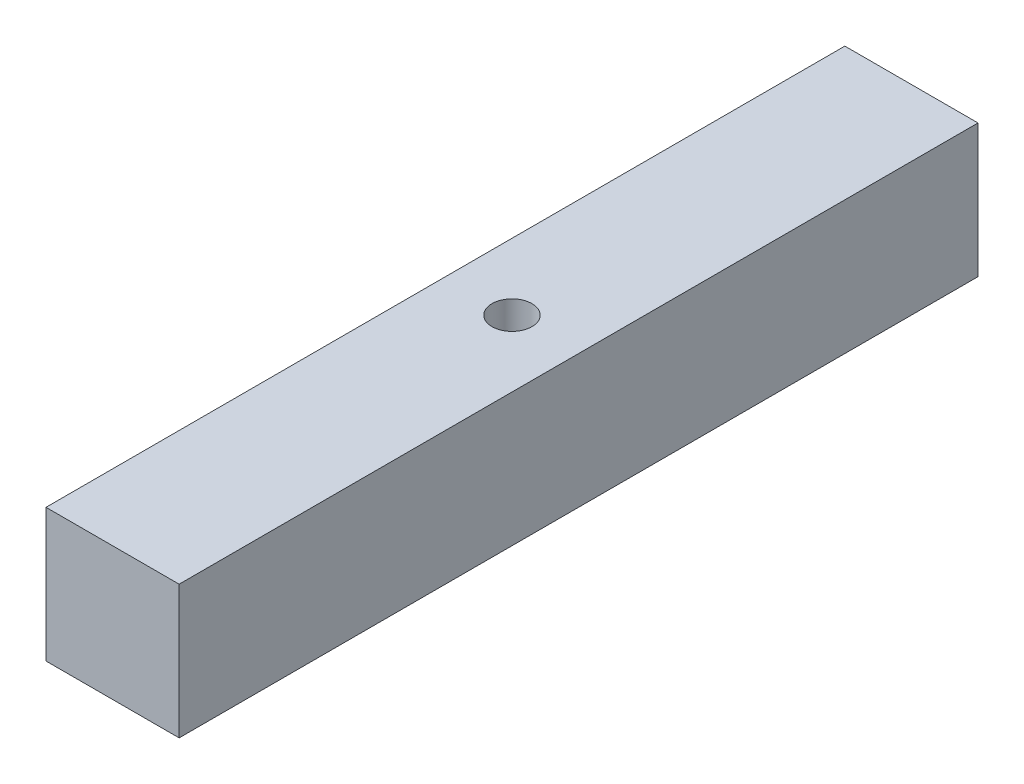
ISO-10303-21;
HEADER;
FILE_DESCRIPTION(('STEP AP214'),'2;1');
FILE_NAME('part.step','',(''),(''),'','','');
FILE_SCHEMA(('AUTOMOTIVE_DESIGN { 1 0 10303 214 1 1 1 1 }'));
ENDSEC;
DATA;
#1=APPLICATION_CONTEXT('core data for automotive mechanical design processes');
#2=APPLICATION_PROTOCOL_DEFINITION('international standard','automotive_design',2000,#1);
#3=PRODUCT_CONTEXT('',#1,'mechanical');
#4=PRODUCT('Part','Part','',(#3));
#5=PRODUCT_RELATED_PRODUCT_CATEGORY('part','',(#4));
#6=PRODUCT_DEFINITION_FORMATION('','',#4);
#7=PRODUCT_DEFINITION_CONTEXT('part definition',#1,'design');
#8=PRODUCT_DEFINITION('design','',#6,#7);
#9=PRODUCT_DEFINITION_SHAPE('','',#8);
#10=(LENGTH_UNIT() NAMED_UNIT(*) SI_UNIT(.MILLI.,.METRE.));
#11=(NAMED_UNIT(*) PLANE_ANGLE_UNIT() SI_UNIT($,.RADIAN.));
#12=(NAMED_UNIT(*) SI_UNIT($,.STERADIAN.) SOLID_ANGLE_UNIT());
#13=UNCERTAINTY_MEASURE_WITH_UNIT(LENGTH_MEASURE(1.E-05),#10,'distance_accuracy_value','');
#14=(GEOMETRIC_REPRESENTATION_CONTEXT(3) GLOBAL_UNCERTAINTY_ASSIGNED_CONTEXT((#13)) GLOBAL_UNIT_ASSIGNED_CONTEXT((#10,
#11,#12)) REPRESENTATION_CONTEXT('',''));
#15=CARTESIAN_POINT('',(0.,0.,0.));
#16=DIRECTION('',(0.,0.,1.));
#17=DIRECTION('',(1.,0.,0.));
#18=AXIS2_PLACEMENT_3D('',#15,#16,#17);
#19=CARTESIAN_POINT('',(500.,-300.,300.));
#20=DIRECTION('',(-1.,0.,0.));
#21=DIRECTION('',(0.,0.,1.));
#22=AXIS2_PLACEMENT_3D('',#19,#20,#21);
#23=PLANE('',#22);
#24=DIRECTION('',(0.,1.,0.));
#25=VECTOR('',#24,1.);
#26=CARTESIAN_POINT('',(500.,-300.,0.));
#27=LINE('',#26,#25);
#28=CARTESIAN_POINT('',(500.,-300.,0.));
#29=VERTEX_POINT('',#28);
#30=CARTESIAN_POINT('',(500.,-250.,0.));
#31=VERTEX_POINT('',#30);
#32=EDGE_CURVE('E98',#29,#31,#27,.T.);
#33=ORIENTED_EDGE('',*,*,#32,.T.);
#34=DIRECTION('',(0.,0.,-1.));
#35=VECTOR('',#34,1.);
#36=CARTESIAN_POINT('',(500.,-250.,300.));
#37=LINE('',#36,#35);
#38=CARTESIAN_POINT('',(500.,-250.,300.));
#39=VERTEX_POINT('',#38);
#40=EDGE_CURVE('E11',#39,#31,#37,.T.);
#41=ORIENTED_EDGE('',*,*,#40,.F.);
#42=DIRECTION('',(0.,1.,0.));
#43=VECTOR('',#42,1.);
#44=CARTESIAN_POINT('',(500.,-300.,300.));
#45=LINE('',#44,#43);
#46=CARTESIAN_POINT('',(500.,-300.,300.));
#47=VERTEX_POINT('',#46);
#48=EDGE_CURVE('E86',#47,#39,#45,.T.);
#49=ORIENTED_EDGE('',*,*,#48,.F.);
#50=DIRECTION('',(0.,0.,-1.));
#51=VECTOR('',#50,1.);
#52=CARTESIAN_POINT('',(500.,-300.,300.));
#53=LINE('',#52,#51);
#54=EDGE_CURVE('E94',#47,#29,#53,.T.);
#55=ORIENTED_EDGE('',*,*,#54,.T.);
#56=EDGE_LOOP('',(#33,#41,#49,#55));
#57=FACE_BOUND('',#56,.T.);
#58=ADVANCED_FACE('F35',(#57),#23,.F.);
#59=CARTESIAN_POINT('',(500.,-250.,300.));
#60=DIRECTION('',(0.,-1.,0.));
#61=DIRECTION('',(0.,0.,-1.));
#62=AXIS2_PLACEMENT_3D('',#59,#60,#61);
#63=PLANE('',#62);
#64=CARTESIAN_POINT('',(475.,-250.,150.));
#65=DIRECTION('',(0.,1.,0.));
#66=DIRECTION('',(0.,0.,1.));
#67=AXIS2_PLACEMENT_3D('',#64,#65,#66);
#68=CIRCLE('',#67,7.50000000000001);
#69=CARTESIAN_POINT('',(475.,-250.,157.5));
#70=VERTEX_POINT('',#69);
#71=EDGE_CURVE('E112',#70,#70,#68,.T.);
#72=ORIENTED_EDGE('',*,*,#71,.F.);
#73=EDGE_LOOP('',(#72));
#74=FACE_BOUND('',#73,.T.);
#75=DIRECTION('',(-1.,0.,0.));
#76=VECTOR('',#75,1.);
#77=CARTESIAN_POINT('',(500.,-250.,0.));
#78=LINE('',#77,#76);
#79=CARTESIAN_POINT('',(450.,-250.,0.));
#80=VERTEX_POINT('',#79);
#81=EDGE_CURVE('E90',#31,#80,#78,.T.);
#82=ORIENTED_EDGE('',*,*,#81,.T.);
#83=DIRECTION('',(0.,0.,-1.));
#84=VECTOR('',#83,1.);
#85=CARTESIAN_POINT('',(450.,-250.,300.));
#86=LINE('',#85,#84);
#87=CARTESIAN_POINT('',(450.,-250.,300.));
#88=VERTEX_POINT('',#87);
#89=EDGE_CURVE('E43',#88,#80,#86,.T.);
#90=ORIENTED_EDGE('',*,*,#89,.F.);
#91=DIRECTION('',(-1.,0.,0.));
#92=VECTOR('',#91,1.);
#93=CARTESIAN_POINT('',(500.,-250.,300.));
#94=LINE('',#93,#92);
#95=EDGE_CURVE('E81',#39,#88,#94,.T.);
#96=ORIENTED_EDGE('',*,*,#95,.F.);
#97=ORIENTED_EDGE('',*,*,#40,.T.);
#98=EDGE_LOOP('',(#82,#90,#96,#97));
#99=FACE_BOUND('',#98,.T.);
#100=ADVANCED_FACE('F89',(#74,#99),#63,.F.);
#101=CARTESIAN_POINT('',(450.,-300.,300.));
#102=DIRECTION('',(1.,0.,0.));
#103=DIRECTION('',(0.,0.,-1.));
#104=AXIS2_PLACEMENT_3D('',#101,#102,#103);
#105=PLANE('',#104);
#106=DIRECTION('',(0.,-1.,0.));
#107=VECTOR('',#106,1.);
#108=CARTESIAN_POINT('',(450.,-300.,0.));
#109=LINE('',#108,#107);
#110=CARTESIAN_POINT('',(450.,-300.,0.));
#111=VERTEX_POINT('',#110);
#112=EDGE_CURVE('E68',#80,#111,#109,.T.);
#113=ORIENTED_EDGE('',*,*,#112,.T.);
#114=DIRECTION('',(0.,0.,-1.));
#115=VECTOR('',#114,1.);
#116=CARTESIAN_POINT('',(450.,-300.,300.));
#117=LINE('',#116,#115);
#118=CARTESIAN_POINT('',(450.,-300.,300.));
#119=VERTEX_POINT('',#118);
#120=EDGE_CURVE('E91',#119,#111,#117,.T.);
#121=ORIENTED_EDGE('',*,*,#120,.F.);
#122=DIRECTION('',(0.,-1.,0.));
#123=VECTOR('',#122,1.);
#124=CARTESIAN_POINT('',(450.,-300.,300.));
#125=LINE('',#124,#123);
#126=EDGE_CURVE('E84',#88,#119,#125,.T.);
#127=ORIENTED_EDGE('',*,*,#126,.F.);
#128=ORIENTED_EDGE('',*,*,#89,.T.);
#129=EDGE_LOOP('',(#113,#121,#127,#128));
#130=FACE_BOUND('',#129,.T.);
#131=ADVANCED_FACE('F92',(#130),#105,.F.);
#132=CARTESIAN_POINT('',(500.,-300.,300.));
#133=DIRECTION('',(0.,1.,0.));
#134=DIRECTION('',(0.,0.,1.));
#135=AXIS2_PLACEMENT_3D('',#132,#133,#134);
#136=PLANE('',#135);
#137=DIRECTION('',(1.,0.,0.));
#138=VECTOR('',#137,1.);
#139=CARTESIAN_POINT('',(500.,-300.,0.));
#140=LINE('',#139,#138);
#141=EDGE_CURVE('E74',#111,#29,#140,.T.);
#142=ORIENTED_EDGE('',*,*,#141,.T.);
#143=ORIENTED_EDGE('',*,*,#54,.F.);
#144=DIRECTION('',(1.,0.,0.));
#145=VECTOR('',#144,1.);
#146=CARTESIAN_POINT('',(500.,-300.,300.));
#147=LINE('',#146,#145);
#148=EDGE_CURVE('E51',#119,#47,#147,.T.);
#149=ORIENTED_EDGE('',*,*,#148,.F.);
#150=ORIENTED_EDGE('',*,*,#120,.T.);
#151=EDGE_LOOP('',(#142,#143,#149,#150));
#152=FACE_BOUND('',#151,.T.);
#153=ADVANCED_FACE('F106',(#152),#136,.F.);
#154=CARTESIAN_POINT('',(0.,0.,300.));
#155=DIRECTION('',(0.,0.,1.));
#156=DIRECTION('',(1.,0.,0.));
#157=AXIS2_PLACEMENT_3D('',#154,#155,#156);
#158=PLANE('',#157);
#159=ORIENTED_EDGE('',*,*,#48,.T.);
#160=ORIENTED_EDGE('',*,*,#95,.T.);
#161=ORIENTED_EDGE('',*,*,#126,.T.);
#162=ORIENTED_EDGE('',*,*,#148,.T.);
#163=EDGE_LOOP('',(#159,#160,#161,#162));
#164=FACE_BOUND('',#163,.T.);
#165=ADVANCED_FACE('F82',(#164),#158,.T.);
#166=CARTESIAN_POINT('',(0.,0.,0.));
#167=DIRECTION('',(0.,0.,1.));
#168=DIRECTION('',(1.,0.,0.));
#169=AXIS2_PLACEMENT_3D('',#166,#167,#168);
#170=PLANE('',#169);
#171=ORIENTED_EDGE('',*,*,#32,.F.);
#172=ORIENTED_EDGE('',*,*,#141,.F.);
#173=ORIENTED_EDGE('',*,*,#112,.F.);
#174=ORIENTED_EDGE('',*,*,#81,.F.);
#175=EDGE_LOOP('',(#171,#172,#173,#174));
#176=FACE_BOUND('',#175,.T.);
#177=ADVANCED_FACE('F109',(#176),#170,.F.);
#178=CARTESIAN_POINT('',(475.,-265.,150.));
#179=DIRECTION('',(0.,1.,0.));
#180=DIRECTION('',(0.,0.,1.));
#181=AXIS2_PLACEMENT_3D('',#178,#179,#180);
#182=CYLINDRICAL_SURFACE('',#181,7.50000000000001);
#183=CARTESIAN_POINT('',(475.,-265.,150.));
#184=DIRECTION('',(0.,1.,0.));
#185=DIRECTION('',(0.,0.,1.));
#186=AXIS2_PLACEMENT_3D('',#183,#184,#185);
#187=CIRCLE('',#186,7.50000000000001);
#188=CARTESIAN_POINT('',(475.,-265.,157.5));
#189=VERTEX_POINT('',#188);
#190=EDGE_CURVE('E101',#189,#189,#187,.T.);
#191=ORIENTED_EDGE('',*,*,#190,.F.);
#192=EDGE_LOOP('',(#191));
#193=FACE_BOUND('',#192,.T.);
#194=ORIENTED_EDGE('',*,*,#71,.T.);
#195=EDGE_LOOP('',(#194));
#196=FACE_BOUND('',#195,.T.);
#197=ADVANCED_FACE('F120',(#193,#196),#182,.F.);
#198=CARTESIAN_POINT('',(475.,-265.,150.));
#199=DIRECTION('',(0.,1.,0.));
#200=DIRECTION('',(0.,0.,1.));
#201=AXIS2_PLACEMENT_3D('',#198,#199,#200);
#202=PLANE('',#201);
#203=ORIENTED_EDGE('',*,*,#190,.T.);
#204=EDGE_LOOP('',(#203));
#205=FACE_BOUND('',#204,.T.);
#206=ADVANCED_FACE('F118',(#205),#202,.T.);
#207=CLOSED_SHELL('',(#58,#100,#131,#153,#165,#177,#197,#206));
#208=MANIFOLD_SOLID_BREP('B2',#207);
#209=ADVANCED_BREP_SHAPE_REPRESENTATION('',(#18,#208),#14);
#210=SHAPE_DEFINITION_REPRESENTATION(#9,#209);
ENDSEC;
END-ISO-10303-21;
